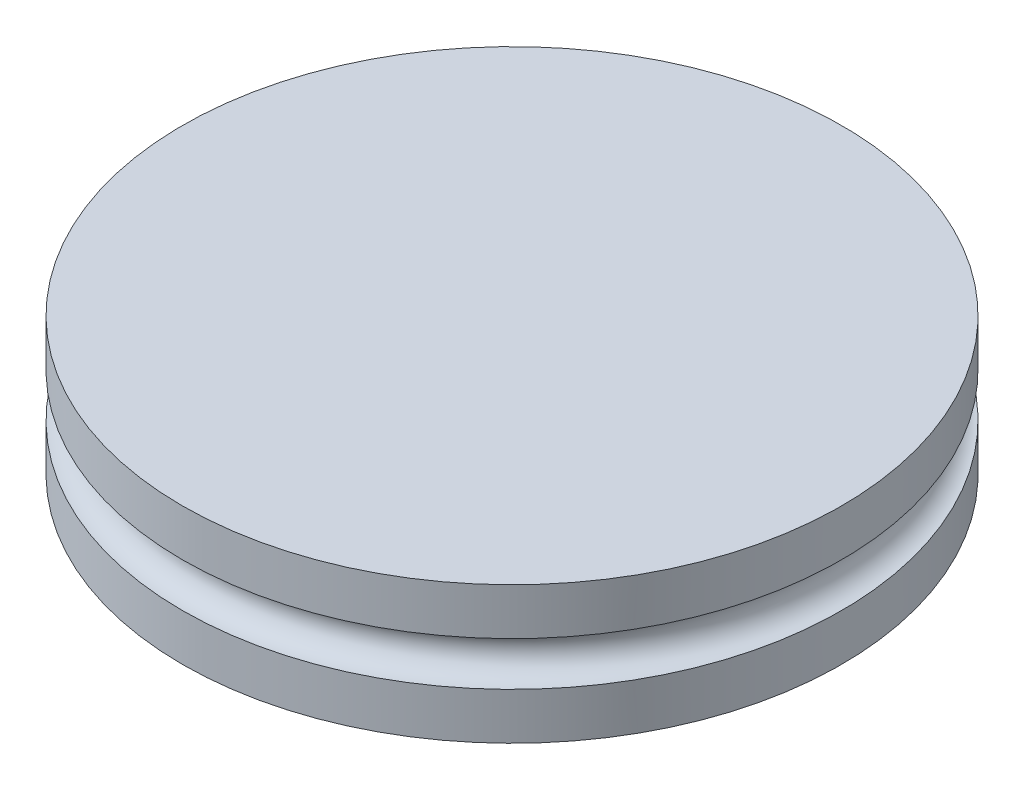
ISO-10303-21;
HEADER;
FILE_DESCRIPTION(('STEP AP214'),'2;1');
FILE_NAME('part.step','',(''),(''),'','','');
FILE_SCHEMA(('AUTOMOTIVE_DESIGN { 1 0 10303 214 1 1 1 1 }'));
ENDSEC;
DATA;
#1=APPLICATION_CONTEXT('core data for automotive mechanical design processes');
#2=APPLICATION_PROTOCOL_DEFINITION('international standard','automotive_design',2000,#1);
#3=PRODUCT_CONTEXT('',#1,'mechanical');
#4=PRODUCT('Part','Part','',(#3));
#5=PRODUCT_RELATED_PRODUCT_CATEGORY('part','',(#4));
#6=PRODUCT_DEFINITION_FORMATION('','',#4);
#7=PRODUCT_DEFINITION_CONTEXT('part definition',#1,'design');
#8=PRODUCT_DEFINITION('design','',#6,#7);
#9=PRODUCT_DEFINITION_SHAPE('','',#8);
#10=(LENGTH_UNIT() NAMED_UNIT(*) SI_UNIT(.MILLI.,.METRE.));
#11=(NAMED_UNIT(*) PLANE_ANGLE_UNIT() SI_UNIT($,.RADIAN.));
#12=(NAMED_UNIT(*) SI_UNIT($,.STERADIAN.) SOLID_ANGLE_UNIT());
#13=UNCERTAINTY_MEASURE_WITH_UNIT(LENGTH_MEASURE(1.E-05),#10,'distance_accuracy_value','');
#14=(GEOMETRIC_REPRESENTATION_CONTEXT(3) GLOBAL_UNCERTAINTY_ASSIGNED_CONTEXT((#13)) GLOBAL_UNIT_ASSIGNED_CONTEXT((#10,
#11,#12)) REPRESENTATION_CONTEXT('',''));
#15=CARTESIAN_POINT('',(0.,0.,0.));
#16=DIRECTION('',(0.,0.,1.));
#17=DIRECTION('',(1.,0.,0.));
#18=AXIS2_PLACEMENT_3D('',#15,#16,#17);
#19=CARTESIAN_POINT('',(-6.604,1.5875,-25.4));
#20=DIRECTION('',(0.,0.,1.));
#21=DIRECTION('',(1.,0.,0.));
#22=AXIS2_PLACEMENT_3D('',#19,#20,#21);
#23=CYLINDRICAL_SURFACE('',#22,0.508);
#24=DIRECTION('',(0.,0.,-1.));
#25=VECTOR('',#24,1.);
#26=CARTESIAN_POINT('',(-6.604,2.0955,-0.254));
#27=LINE('',#26,#25);
#28=CARTESIAN_POINT('',(-6.604,2.0955,-0.254000000000001));
#29=VERTEX_POINT('',#28);
#30=CARTESIAN_POINT('',(-6.604,2.0955,-3.80152390496233));
#31=VERTEX_POINT('',#30);
#32=EDGE_CURVE('E56',#29,#31,#27,.T.);
#33=ORIENTED_EDGE('',*,*,#32,.T.);
#34=CARTESIAN_POINT('',(-6.604,2.0955,-3.80152390496233));
#35=CARTESIAN_POINT('',(-6.60194500725395,2.09550005520869,-3.80097468662734));
#36=CARTESIAN_POINT('',(-6.59988976561903,2.09548757900723,-3.80042528097354));
#37=CARTESIAN_POINT('',(-6.56854955124776,2.09510643460792,-3.79204560219779));
#38=CARTESIAN_POINT('',(-6.53924744973282,2.0922086193289,-3.78418642432003));
#39=CARTESIAN_POINT('',(-6.48147940567435,2.08138278069412,-3.76864469662426));
#40=CARTESIAN_POINT('',(-6.45301596463382,2.07344104443697,-3.76096268766341));
#41=CARTESIAN_POINT('',(-6.39779858864904,2.05270277080752,-3.7460163548388));
#42=CARTESIAN_POINT('',(-6.37104411227848,2.03990778002377,-3.73875189876164));
#43=CARTESIAN_POINT('',(-6.32006218056484,2.00977896150066,-3.72487188422996));
#44=CARTESIAN_POINT('',(-6.29583296281328,1.99244832930374,-3.71825587341249));
#45=CARTESIAN_POINT('',(-6.25101238885074,1.95399885771533,-3.70598843268593));
#46=CARTESIAN_POINT('',(-6.2303688500756,1.93294533875432,-3.70032321598273));
#47=CARTESIAN_POINT('',(-6.19293419575943,1.88742795646427,-3.69003046827288));
#48=CARTESIAN_POINT('',(-6.17614281841295,1.86296432507937,-3.68540286674701));
#49=CARTESIAN_POINT('',(-6.14751242171477,1.81222701729233,-3.67750137748562));
#50=CARTESIAN_POINT('',(-6.13552254873757,1.78604488980152,-3.6741862992046));
#51=CARTESIAN_POINT('',(-6.11611312462507,1.73191760808839,-3.66881522446567));
#52=CARTESIAN_POINT('',(-6.10869251056624,1.70397286556301,-3.66675893518271));
#53=CARTESIAN_POINT('',(-6.09885375436955,1.64808410956029,-3.66403174671662));
#54=CARTESIAN_POINT('',(-6.09628201589497,1.62016913068494,-3.66331831165901));
#55=CARTESIAN_POINT('',(-6.09576205839802,1.56429432890378,-3.66317410409304));
#56=CARTESIAN_POINT('',(-6.09781333935618,1.53633451117454,-3.66374319286864));
#57=CARTESIAN_POINT('',(-6.10640481280892,1.48157268429325,-3.66612492134637));
#58=CARTESIAN_POINT('',(-6.11288180762574,1.45475995000079,-3.66792005340607));
#59=CARTESIAN_POINT('',(-6.1300395236544,1.40262524683313,-3.67266958846798));
#60=CARTESIAN_POINT('',(-6.14072042878312,1.37730334323601,-3.67562404218934));
#61=CARTESIAN_POINT('',(-6.16607402311591,1.32856485800724,-3.68262552224985));
#62=CARTESIAN_POINT('',(-6.18078775316986,1.30517127130051,-3.68668377821448));
#63=CARTESIAN_POINT('',(-6.21369426497066,1.2611872141778,-3.6957412245746));
#64=CARTESIAN_POINT('',(-6.23188708915355,1.24059677795831,-3.7007404264472));
#65=CARTESIAN_POINT('',(-6.27179508523877,1.20215119620544,-3.71168079589234));
#66=CARTESIAN_POINT('',(-6.29359738832829,1.18439314248465,-3.71764515099989));
#67=CARTESIAN_POINT('',(-6.33970921263849,1.15276230281283,-3.73022582172088));
#68=CARTESIAN_POINT('',(-6.36402061794464,1.13889246599601,-3.7368426270907));
#69=CARTESIAN_POINT('',(-6.41604201684356,1.11462578703414,-3.75096070381643));
#70=CARTESIAN_POINT('',(-6.44386925924579,1.10449744281671,-3.75849137529168));
#71=CARTESIAN_POINT('',(-6.50073520812444,1.08923867790693,-3.77383207475027));
#72=CARTESIAN_POINT('',(-6.52977129408427,1.08409797901327,-3.78164149370742));
#73=CARTESIAN_POINT('',(-6.57191445242169,1.0803478306571,-3.79294058569069));
#74=CARTESIAN_POINT('',(-6.58487163288711,1.07969469375306,-3.79640977478439));
#75=CARTESIAN_POINT('',(-6.59988952563702,1.07951248264046,-3.80042521527329));
#76=CARTESIAN_POINT('',(-6.60194475348016,1.0795000113713,-3.80097461708573));
#77=CARTESIAN_POINT('',(-6.604,1.0795,-3.80152390496233));
#78=B_SPLINE_CURVE_WITH_KNOTS('',3,(#34,#35,#36,#37,#38,#39,#40,#41,#42,#43,#44,#45,#46,#47,#48,
#49,#50,#51,#52,#53,#54,#55,#56,#57,#58,#59,#60,#61,#62,#63,#64,#65,#66,#67,#68,#69,#70,#71,#72,
#73,#74,#75,#76,#77),.UNSPECIFIED.,.F.,.F.,(4,2,2,2,2,2,2,2,2,2,2,2,2,2,2,2,2,2,2,2,2,4),(0.,
0.00638216369335467,0.0973170859201828,0.188500297306523,0.279654475681277,0.370744604341707,
0.460371577231707,0.549992456974448,0.636521812956095,0.723031032440619,0.806750625624534,
0.890461164246118,0.973000660036266,1.0555437672486,1.13896025410612,1.22237775849605,
1.30822395625124,1.3941350915278,1.48537034467856,1.57641718453612,1.61667376452314,
1.62305592821649),.UNSPECIFIED.);
#79=CARTESIAN_POINT('',(-6.604,1.0795,-3.80152390496233));
#80=VERTEX_POINT('',#79);
#81=EDGE_CURVE('E110',#31,#80,#78,.T.);
#82=ORIENTED_EDGE('',*,*,#81,.T.);
#83=DIRECTION('',(0.,0.,-1.));
#84=VECTOR('',#83,1.);
#85=CARTESIAN_POINT('',(-6.604,1.0795,-0.254));
#86=LINE('',#85,#84);
#87=CARTESIAN_POINT('',(-6.604,1.0795,-0.254));
#88=VERTEX_POINT('',#87);
#89=EDGE_CURVE('E130',#88,#80,#86,.T.);
#90=ORIENTED_EDGE('',*,*,#89,.F.);
#91=CARTESIAN_POINT('',(-6.604,1.5875,-0.254000000000001));
#92=DIRECTION('',(0.,0.,-1.));
#93=DIRECTION('',(-1.,0.,0.));
#94=AXIS2_PLACEMENT_3D('',#91,#92,#93);
#95=CIRCLE('',#94,0.508);
#96=EDGE_CURVE('E41',#29,#88,#95,.F.);
#97=ORIENTED_EDGE('',*,*,#96,.F.);
#98=EDGE_LOOP('',(#33,#82,#90,#97));
#99=FACE_BOUND('',#98,.T.);
#100=DIRECTION('',(0.,0.,1.));
#101=VECTOR('',#100,1.);
#102=CARTESIAN_POINT('',(-6.604,1.0795,0.254));
#103=LINE('',#102,#101);
#104=CARTESIAN_POINT('',(-6.604,1.0795,0.254000000000001));
#105=VERTEX_POINT('',#104);
#106=CARTESIAN_POINT('',(-6.604,1.0795,3.80152390496233));
#107=VERTEX_POINT('',#106);
#108=EDGE_CURVE('E48',#105,#107,#103,.T.);
#109=ORIENTED_EDGE('',*,*,#108,.T.);
#110=CARTESIAN_POINT('',(-6.604,1.0795,3.80152390496233));
#111=CARTESIAN_POINT('',(-6.60194500725395,1.07949994479131,3.80097468662734));
#112=CARTESIAN_POINT('',(-6.59988976561903,1.07951242099277,3.80042528097354));
#113=CARTESIAN_POINT('',(-6.56854955124776,1.07989356539208,3.79204560219779));
#114=CARTESIAN_POINT('',(-6.53924744973282,1.0827913806711,3.78418642432003));
#115=CARTESIAN_POINT('',(-6.48147940567435,1.09361721930588,3.76864469662426));
#116=CARTESIAN_POINT('',(-6.45301596463382,1.10155895556303,3.76096268766341));
#117=CARTESIAN_POINT('',(-6.39779858864904,1.12229722919248,3.7460163548388));
#118=CARTESIAN_POINT('',(-6.37104411227848,1.13509221997623,3.73875189876164));
#119=CARTESIAN_POINT('',(-6.32006218056484,1.16522103849934,3.72487188422996));
#120=CARTESIAN_POINT('',(-6.29583296281328,1.18255167069626,3.71825587341249));
#121=CARTESIAN_POINT('',(-6.25101238885074,1.22100114228467,3.70598843268593));
#122=CARTESIAN_POINT('',(-6.2303688500756,1.24205466124568,3.70032321598273));
#123=CARTESIAN_POINT('',(-6.19293419575943,1.28757204353573,3.69003046827288));
#124=CARTESIAN_POINT('',(-6.17614281841295,1.31203567492063,3.68540286674701));
#125=CARTESIAN_POINT('',(-6.14751242171477,1.36277298270767,3.67750137748562));
#126=CARTESIAN_POINT('',(-6.13552254873757,1.38895511019847,3.6741862992046));
#127=CARTESIAN_POINT('',(-6.11611312462507,1.44308239191161,3.66881522446567));
#128=CARTESIAN_POINT('',(-6.10869251056624,1.47102713443699,3.66675893518271));
#129=CARTESIAN_POINT('',(-6.09885375436955,1.52691589043971,3.66403174671662));
#130=CARTESIAN_POINT('',(-6.09628201589497,1.55483086931506,3.66331831165901));
#131=CARTESIAN_POINT('',(-6.09576205839802,1.61070567109622,3.66317410409304));
#132=CARTESIAN_POINT('',(-6.09781333935618,1.63866548882546,3.66374319286864));
#133=CARTESIAN_POINT('',(-6.10640481280892,1.69342731570675,3.66612492134637));
#134=CARTESIAN_POINT('',(-6.11288180762574,1.72024004999921,3.66792005340607));
#135=CARTESIAN_POINT('',(-6.1300395236544,1.77237475316687,3.67266958846798));
#136=CARTESIAN_POINT('',(-6.14072042878312,1.79769665676399,3.67562404218934));
#137=CARTESIAN_POINT('',(-6.16607402311591,1.84643514199276,3.68262552224985));
#138=CARTESIAN_POINT('',(-6.18078775316986,1.86982872869949,3.68668377821448));
#139=CARTESIAN_POINT('',(-6.21369426497066,1.9138127858222,3.6957412245746));
#140=CARTESIAN_POINT('',(-6.23188708915355,1.93440322204169,3.7007404264472));
#141=CARTESIAN_POINT('',(-6.27179508523877,1.97284880379456,3.71168079589234));
#142=CARTESIAN_POINT('',(-6.29359738832829,1.99060685751535,3.71764515099989));
#143=CARTESIAN_POINT('',(-6.33970921263849,2.02223769718717,3.73022582172088));
#144=CARTESIAN_POINT('',(-6.36402061794464,2.03610753400399,3.7368426270907));
#145=CARTESIAN_POINT('',(-6.41604201684356,2.06037421296586,3.75096070381643));
#146=CARTESIAN_POINT('',(-6.44386925924579,2.07050255718329,3.75849137529168));
#147=CARTESIAN_POINT('',(-6.50073520812444,2.08576132209307,3.77383207475027));
#148=CARTESIAN_POINT('',(-6.52977129408427,2.09090202098673,3.78164149370742));
#149=CARTESIAN_POINT('',(-6.57191445242169,2.0946521693429,3.79294058569069));
#150=CARTESIAN_POINT('',(-6.58487163288711,2.09530530624694,3.79640977478439));
#151=CARTESIAN_POINT('',(-6.59988952563702,2.09548751735954,3.80042521527329));
#152=CARTESIAN_POINT('',(-6.60194475348016,2.0954999886287,3.80097461708573));
#153=CARTESIAN_POINT('',(-6.604,2.0955,3.80152390496233));
#154=B_SPLINE_CURVE_WITH_KNOTS('',3,(#110,#111,#112,#113,#114,#115,#116,#117,#118,#119,#120,
#121,#122,#123,#124,#125,#126,#127,#128,#129,#130,#131,#132,#133,#134,#135,#136,#137,#138,#139,
#140,#141,#142,#143,#144,#145,#146,#147,#148,#149,#150,#151,#152,#153),.UNSPECIFIED.,.F.,.F.,(4,
2,2,2,2,2,2,2,2,2,2,2,2,2,2,2,2,2,2,2,2,4),(0.,0.00638216369335467,0.0973170859201845,
0.188500297306524,0.279654475681277,0.370744604341706,0.460371577231705,0.549992456974447,
0.636521812956094,0.723031032440619,0.806750625624534,0.890461164246118,0.973000660036266,
1.0555437672486,1.13896025410612,1.22237775849604,1.30822395625124,1.3941350915278,
1.48537034467856,1.57641718453611,1.61667376452314,1.62305592821649),.UNSPECIFIED.);
#155=CARTESIAN_POINT('',(-6.604,2.0955,3.80152390496233));
#156=VERTEX_POINT('',#155);
#157=EDGE_CURVE('E107',#107,#156,#154,.T.);
#158=ORIENTED_EDGE('',*,*,#157,.T.);
#159=DIRECTION('',(0.,0.,1.));
#160=VECTOR('',#159,1.);
#161=CARTESIAN_POINT('',(-6.604,2.0955,0.254));
#162=LINE('',#161,#160);
#163=CARTESIAN_POINT('',(-6.604,2.0955,0.254));
#164=VERTEX_POINT('',#163);
#165=EDGE_CURVE('E114',#164,#156,#162,.T.);
#166=ORIENTED_EDGE('',*,*,#165,.F.);
#167=CARTESIAN_POINT('',(-6.604,1.5875,0.254000000000001));
#168=DIRECTION('',(0.,0.,-1.));
#169=DIRECTION('',(-1.,0.,0.));
#170=AXIS2_PLACEMENT_3D('',#167,#168,#169);
#171=CIRCLE('',#170,0.508);
#172=EDGE_CURVE('E11',#164,#105,#171,.F.);
#173=ORIENTED_EDGE('',*,*,#172,.T.);
#174=EDGE_LOOP('',(#109,#158,#166,#173));
#175=FACE_BOUND('',#174,.T.);
#176=ADVANCED_FACE('F33',(#99,#175),#23,.F.);
#177=CARTESIAN_POINT('',(0.,3.175,0.));
#178=DIRECTION('',(0.,-1.,0.));
#179=DIRECTION('',(0.,0.,-1.));
#180=AXIS2_PLACEMENT_3D('',#177,#178,#179);
#181=CYLINDRICAL_SURFACE('',#180,7.62);
#182=CARTESIAN_POINT('',(0.,1.0795,0.));
#183=DIRECTION('',(0.,1.,0.));
#184=DIRECTION('',(0.,0.,1.));
#185=AXIS2_PLACEMENT_3D('',#182,#183,#184);
#186=CIRCLE('',#185,7.62);
#187=CARTESIAN_POINT('',(-7.615765490087,1.0795,-0.254));
#188=VERTEX_POINT('',#187);
#189=EDGE_CURVE('E136',#80,#188,#186,.T.);
#190=ORIENTED_EDGE('',*,*,#189,.F.);
#191=CARTESIAN_POINT('',(0.,1.0795,0.));
#192=DIRECTION('',(0.,1.,0.));
#193=DIRECTION('',(0.,0.,1.));
#194=AXIS2_PLACEMENT_3D('',#191,#192,#193);
#195=CIRCLE('',#194,7.62);
#196=EDGE_CURVE('E154',#80,#107,#195,.F.);
#197=ORIENTED_EDGE('',*,*,#196,.T.);
#198=CARTESIAN_POINT('',(0.,1.0795,0.));
#199=DIRECTION('',(0.,-1.,0.));
#200=DIRECTION('',(0.,0.,-1.));
#201=AXIS2_PLACEMENT_3D('',#198,#199,#200);
#202=CIRCLE('',#201,7.62);
#203=CARTESIAN_POINT('',(-7.615765490087,1.0795,0.254));
#204=VERTEX_POINT('',#203);
#205=EDGE_CURVE('E101',#107,#204,#202,.T.);
#206=ORIENTED_EDGE('',*,*,#205,.T.);
#207=DIRECTION('',(0.,-1.,0.));
#208=VECTOR('',#207,1.);
#209=CARTESIAN_POINT('',(-7.615765490087,3.175,0.254));
#210=LINE('',#209,#208);
#211=CARTESIAN_POINT('',(-7.615765490087,2.0955,0.254));
#212=VERTEX_POINT('',#211);
#213=EDGE_CURVE('E96',#204,#212,#210,.F.);
#214=ORIENTED_EDGE('',*,*,#213,.T.);
#215=CARTESIAN_POINT('',(0.,2.0955,0.));
#216=DIRECTION('',(0.,1.,0.));
#217=DIRECTION('',(0.,0.,1.));
#218=AXIS2_PLACEMENT_3D('',#215,#216,#217);
#219=CIRCLE('',#218,7.62);
#220=EDGE_CURVE('E89',#212,#156,#219,.T.);
#221=ORIENTED_EDGE('',*,*,#220,.T.);
#222=CARTESIAN_POINT('',(0.,2.0955,0.));
#223=DIRECTION('',(0.,-1.,0.));
#224=DIRECTION('',(0.,0.,-1.));
#225=AXIS2_PLACEMENT_3D('',#222,#223,#224);
#226=CIRCLE('',#225,7.62);
#227=EDGE_CURVE('E94',#156,#31,#226,.F.);
#228=ORIENTED_EDGE('',*,*,#227,.T.);
#229=CARTESIAN_POINT('',(0.,2.0955,0.));
#230=DIRECTION('',(0.,-1.,0.));
#231=DIRECTION('',(0.,0.,-1.));
#232=AXIS2_PLACEMENT_3D('',#229,#230,#231);
#233=CIRCLE('',#232,7.62);
#234=CARTESIAN_POINT('',(-7.615765490087,2.0955,-0.254));
#235=VERTEX_POINT('',#234);
#236=EDGE_CURVE('E138',#235,#31,#233,.T.);
#237=ORIENTED_EDGE('',*,*,#236,.F.);
#238=DIRECTION('',(0.,-1.,0.));
#239=VECTOR('',#238,1.);
#240=CARTESIAN_POINT('',(-7.615765490087,3.175,-0.254));
#241=LINE('',#240,#239);
#242=EDGE_CURVE('E134',#188,#235,#241,.F.);
#243=ORIENTED_EDGE('',*,*,#242,.F.);
#244=EDGE_LOOP('',(#190,#197,#206,#214,#221,#228,#237,#243));
#245=FACE_BOUND('',#244,.T.);
#246=CARTESIAN_POINT('',(0.,0.,0.));
#247=DIRECTION('',(0.,1.,0.));
#248=DIRECTION('',(0.,0.,1.));
#249=AXIS2_PLACEMENT_3D('',#246,#247,#248);
#250=CIRCLE('',#249,7.62);
#251=CARTESIAN_POINT('',(0.,0.,7.62));
#252=VERTEX_POINT('',#251);
#253=EDGE_CURVE('E140',#252,#252,#250,.T.);
#254=ORIENTED_EDGE('',*,*,#253,.T.);
#255=EDGE_LOOP('',(#254));
#256=FACE_BOUND('',#255,.T.);
#257=CARTESIAN_POINT('',(0.,3.175,0.));
#258=DIRECTION('',(0.,1.,0.));
#259=DIRECTION('',(0.,0.,1.));
#260=AXIS2_PLACEMENT_3D('',#257,#258,#259);
#261=CIRCLE('',#260,7.62);
#262=CARTESIAN_POINT('',(0.,3.175,7.62));
#263=VERTEX_POINT('',#262);
#264=EDGE_CURVE('E141',#263,#263,#261,.T.);
#265=ORIENTED_EDGE('',*,*,#264,.F.);
#266=EDGE_LOOP('',(#265));
#267=FACE_BOUND('',#266,.T.);
#268=ADVANCED_FACE('F35',(#245,#256,#267),#181,.T.);
#269=CARTESIAN_POINT('',(0.,3.175,0.));
#270=DIRECTION('',(0.,1.,0.));
#271=DIRECTION('',(0.,0.,1.));
#272=AXIS2_PLACEMENT_3D('',#269,#270,#271);
#273=PLANE('',#272);
#274=ORIENTED_EDGE('',*,*,#264,.T.);
#275=EDGE_LOOP('',(#274));
#276=FACE_BOUND('',#275,.T.);
#277=ADVANCED_FACE('F193',(#276),#273,.T.);
#278=CARTESIAN_POINT('',(0.,0.,0.));
#279=DIRECTION('',(0.,1.,0.));
#280=DIRECTION('',(0.,0.,1.));
#281=AXIS2_PLACEMENT_3D('',#278,#279,#280);
#282=PLANE('',#281);
#283=ORIENTED_EDGE('',*,*,#253,.F.);
#284=EDGE_LOOP('',(#283));
#285=FACE_BOUND('',#284,.T.);
#286=ADVANCED_FACE('F189',(#285),#282,.F.);
#287=CARTESIAN_POINT('',(-6.604,2.0955,-0.254));
#288=DIRECTION('',(0.,-1.,0.));
#289=DIRECTION('',(0.,0.,-1.));
#290=AXIS2_PLACEMENT_3D('',#287,#288,#289);
#291=PLANE('',#290);
#292=ORIENTED_EDGE('',*,*,#236,.T.);
#293=ORIENTED_EDGE('',*,*,#32,.F.);
#294=DIRECTION('',(-1.,0.,0.));
#295=VECTOR('',#294,1.);
#296=CARTESIAN_POINT('',(-6.604,2.0955,-0.254));
#297=LINE('',#296,#295);
#298=EDGE_CURVE('E125',#29,#235,#297,.T.);
#299=ORIENTED_EDGE('',*,*,#298,.T.);
#300=EDGE_LOOP('',(#292,#293,#299));
#301=FACE_BOUND('',#300,.T.);
#302=ADVANCED_FACE('F187',(#301),#291,.T.);
#303=CARTESIAN_POINT('',(-6.604,1.0795,-0.254));
#304=DIRECTION('',(0.,1.,0.));
#305=DIRECTION('',(0.,0.,1.));
#306=AXIS2_PLACEMENT_3D('',#303,#304,#305);
#307=PLANE('',#306);
#308=ORIENTED_EDGE('',*,*,#189,.T.);
#309=DIRECTION('',(1.,0.,0.));
#310=VECTOR('',#309,1.);
#311=CARTESIAN_POINT('',(-6.604,1.0795,-0.254));
#312=LINE('',#311,#310);
#313=EDGE_CURVE('E127',#188,#88,#312,.T.);
#314=ORIENTED_EDGE('',*,*,#313,.T.);
#315=ORIENTED_EDGE('',*,*,#89,.T.);
#316=EDGE_LOOP('',(#308,#314,#315));
#317=FACE_BOUND('',#316,.T.);
#318=ADVANCED_FACE('F153',(#317),#307,.T.);
#319=CARTESIAN_POINT('',(0.,0.,-0.254));
#320=DIRECTION('',(0.,0.,-1.));
#321=DIRECTION('',(-1.,0.,0.));
#322=AXIS2_PLACEMENT_3D('',#319,#320,#321);
#323=PLANE('',#322);
#324=ORIENTED_EDGE('',*,*,#242,.T.);
#325=ORIENTED_EDGE('',*,*,#298,.F.);
#326=ORIENTED_EDGE('',*,*,#96,.T.);
#327=ORIENTED_EDGE('',*,*,#313,.F.);
#328=EDGE_LOOP('',(#324,#325,#326,#327));
#329=FACE_BOUND('',#328,.T.);
#330=ADVANCED_FACE('F148',(#329),#323,.T.);
#331=CARTESIAN_POINT('',(-6.604,1.0795,0.254));
#332=DIRECTION('',(0.,-1.,0.));
#333=DIRECTION('',(0.,0.,-1.));
#334=AXIS2_PLACEMENT_3D('',#331,#332,#333);
#335=PLANE('',#334);
#336=ORIENTED_EDGE('',*,*,#108,.F.);
#337=DIRECTION('',(1.,0.,0.));
#338=VECTOR('',#337,1.);
#339=CARTESIAN_POINT('',(-6.604,1.0795,0.254));
#340=LINE('',#339,#338);
#341=EDGE_CURVE('E118',#204,#105,#340,.T.);
#342=ORIENTED_EDGE('',*,*,#341,.F.);
#343=ORIENTED_EDGE('',*,*,#205,.F.);
#344=EDGE_LOOP('',(#336,#342,#343));
#345=FACE_BOUND('',#344,.T.);
#346=ADVANCED_FACE('F179',(#345),#335,.F.);
#347=CARTESIAN_POINT('',(-6.604,2.0955,0.254));
#348=DIRECTION('',(0.,1.,0.));
#349=DIRECTION('',(0.,0.,1.));
#350=AXIS2_PLACEMENT_3D('',#347,#348,#349);
#351=PLANE('',#350);
#352=DIRECTION('',(-1.,0.,0.));
#353=VECTOR('',#352,1.);
#354=CARTESIAN_POINT('',(-6.604,2.0955,0.254));
#355=LINE('',#354,#353);
#356=EDGE_CURVE('E117',#164,#212,#355,.T.);
#357=ORIENTED_EDGE('',*,*,#356,.F.);
#358=ORIENTED_EDGE('',*,*,#165,.T.);
#359=ORIENTED_EDGE('',*,*,#220,.F.);
#360=EDGE_LOOP('',(#357,#358,#359));
#361=FACE_BOUND('',#360,.T.);
#362=ADVANCED_FACE('F116',(#361),#351,.F.);
#363=CARTESIAN_POINT('',(0.,0.,0.254));
#364=DIRECTION('',(0.,0.,-1.));
#365=DIRECTION('',(-1.,0.,0.));
#366=AXIS2_PLACEMENT_3D('',#363,#364,#365);
#367=PLANE('',#366);
#368=ORIENTED_EDGE('',*,*,#341,.T.);
#369=ORIENTED_EDGE('',*,*,#172,.F.);
#370=ORIENTED_EDGE('',*,*,#356,.T.);
#371=ORIENTED_EDGE('',*,*,#213,.F.);
#372=EDGE_LOOP('',(#368,#369,#370,#371));
#373=FACE_BOUND('',#372,.T.);
#374=ADVANCED_FACE('F174',(#373),#367,.F.);
#375=CARTESIAN_POINT('',(0.,1.5875,0.));
#376=DIRECTION('',(0.,-1.,0.));
#377=DIRECTION('',(0.,0.,-1.));
#378=AXIS2_PLACEMENT_3D('',#375,#376,#377);
#379=TOROIDAL_SURFACE('',#378,7.62,0.508000000000001);
#380=ORIENTED_EDGE('',*,*,#81,.F.);
#381=ORIENTED_EDGE('',*,*,#227,.F.);
#382=ORIENTED_EDGE('',*,*,#157,.F.);
#383=ORIENTED_EDGE('',*,*,#196,.F.);
#384=EDGE_LOOP('',(#380,#381,#382,#383));
#385=FACE_BOUND('',#384,.T.);
#386=ADVANCED_FACE('F106',(#385),#379,.F.);
#387=CLOSED_SHELL('',(#176,#268,#277,#286,#302,#318,#330,#346,#362,#374,#386));
#388=MANIFOLD_SOLID_BREP('B2',#387);
#389=ADVANCED_BREP_SHAPE_REPRESENTATION('',(#18,#388),#14);
#390=SHAPE_DEFINITION_REPRESENTATION(#9,#389);
ENDSEC;
END-ISO-10303-21;
